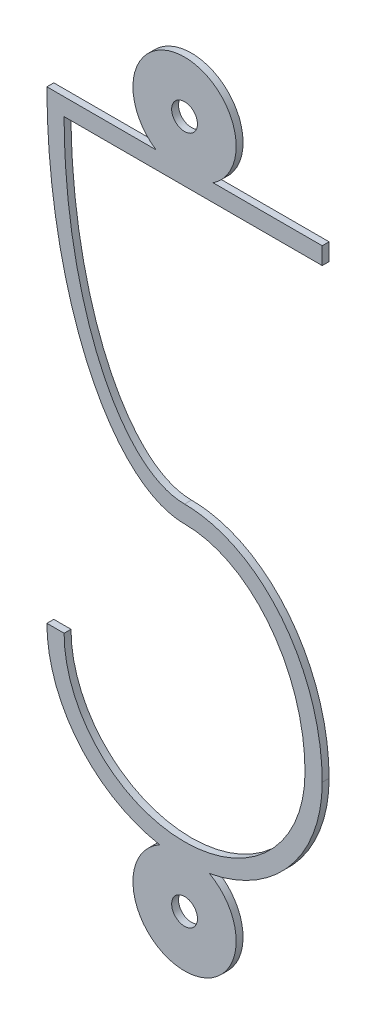
ISO-10303-21;
HEADER;
FILE_DESCRIPTION(('STEP AP214'),'2;1');
FILE_NAME('part.step','',(''),(''),'','','');
FILE_SCHEMA(('AUTOMOTIVE_DESIGN { 1 0 10303 214 1 1 1 1 }'));
ENDSEC;
DATA;
#1=APPLICATION_CONTEXT('core data for automotive mechanical design processes');
#2=APPLICATION_PROTOCOL_DEFINITION('international standard','automotive_design',2000,#1);
#3=PRODUCT_CONTEXT('',#1,'mechanical');
#4=PRODUCT('Part','Part','',(#3));
#5=PRODUCT_RELATED_PRODUCT_CATEGORY('part','',(#4));
#6=PRODUCT_DEFINITION_FORMATION('','',#4);
#7=PRODUCT_DEFINITION_CONTEXT('part definition',#1,'design');
#8=PRODUCT_DEFINITION('design','',#6,#7);
#9=PRODUCT_DEFINITION_SHAPE('','',#8);
#10=(LENGTH_UNIT() NAMED_UNIT(*) SI_UNIT(.MILLI.,.METRE.));
#11=(NAMED_UNIT(*) PLANE_ANGLE_UNIT() SI_UNIT($,.RADIAN.));
#12=(NAMED_UNIT(*) SI_UNIT($,.STERADIAN.) SOLID_ANGLE_UNIT());
#13=UNCERTAINTY_MEASURE_WITH_UNIT(LENGTH_MEASURE(1.E-05),#10,'distance_accuracy_value','');
#14=(GEOMETRIC_REPRESENTATION_CONTEXT(3) GLOBAL_UNCERTAINTY_ASSIGNED_CONTEXT((#13)) GLOBAL_UNIT_ASSIGNED_CONTEXT((#10,
#11,#12)) REPRESENTATION_CONTEXT('',''));
#15=CARTESIAN_POINT('',(0.,0.,0.));
#16=DIRECTION('',(0.,0.,1.));
#17=DIRECTION('',(1.,0.,0.));
#18=AXIS2_PLACEMENT_3D('',#15,#16,#17);
#19=CARTESIAN_POINT('',(-1.32932183617601E-13,8.75000000000002,0.1));
#20=DIRECTION('',(0.,0.,-1.));
#21=DIRECTION('',(-1.,0.,0.));
#22=AXIS2_PLACEMENT_3D('',#19,#20,#21);
#23=PLANE('',#22);
#24=CARTESIAN_POINT('',(-1.32932183617601E-13,8.75000000000002,0.1));
#25=DIRECTION('',(0.,0.,1.));
#26=DIRECTION('',(0.,1.,0.));
#27=AXIS2_PLACEMENT_3D('',#24,#25,#26);
#28=ELLIPSE('',#27,8.99999999999974,4.00000000000008);
#29=CARTESIAN_POINT('',(-4.00000000000022,8.74999999999979,0.1));
#30=VERTEX_POINT('',#29);
#31=CARTESIAN_POINT('',(0.,-0.250000000000186,0.1));
#32=VERTEX_POINT('',#31);
#33=EDGE_CURVE('E195',#30,#32,#28,.T.);
#34=ORIENTED_EDGE('',*,*,#33,.T.);
#35=CARTESIAN_POINT('',(0.,-4.74999999999968,0.1));
#36=DIRECTION('',(0.,0.,-1.));
#37=DIRECTION('',(0.,1.,0.));
#38=AXIS2_PLACEMENT_3D('',#35,#36,#37);
#39=ELLIPSE('',#38,4.49999999999949,3.49999999999958);
#40=CARTESIAN_POINT('',(3.49999999999954,-4.74999999999968,0.1));
#41=VERTEX_POINT('',#40);
#42=EDGE_CURVE('E113',#32,#41,#39,.T.);
#43=ORIENTED_EDGE('',*,*,#42,.T.);
#44=CARTESIAN_POINT('',(0.,-4.74999999999968,0.1));
#45=DIRECTION('',(0.,0.,-1.));
#46=DIRECTION('',(-1.,0.,0.));
#47=AXIS2_PLACEMENT_3D('',#44,#45,#46);
#48=CIRCLE('',#47,3.49999999999954);
#49=CARTESIAN_POINT('',(-3.49999999999949,-4.74999999999968,0.1));
#50=VERTEX_POINT('',#49);
#51=EDGE_CURVE('E228',#41,#50,#48,.T.);
#52=ORIENTED_EDGE('',*,*,#51,.T.);
#53=DIRECTION('',(-1.,0.,0.));
#54=VECTOR('',#53,1.);
#55=CARTESIAN_POINT('',(-4.00000000000022,-4.74999999999968,0.1));
#56=LINE('',#55,#54);
#57=CARTESIAN_POINT('',(-4.00000000000021,-4.74999999999968,0.1));
#58=VERTEX_POINT('',#57);
#59=EDGE_CURVE('E247',#50,#58,#56,.T.);
#60=ORIENTED_EDGE('',*,*,#59,.T.);
#61=CARTESIAN_POINT('',(0.,-4.74999999999968,0.1));
#62=DIRECTION('',(0.,0.,1.));
#63=DIRECTION('',(1.,0.,0.));
#64=AXIS2_PLACEMENT_3D('',#61,#62,#63);
#65=CIRCLE('',#64,4.00000000000021);
#66=CARTESIAN_POINT('',(-0.720779017653949,-8.68452380952371,0.1));
#67=VERTEX_POINT('',#66);
#68=EDGE_CURVE('E244',#58,#67,#65,.T.);
#69=ORIENTED_EDGE('',*,*,#68,.T.);
#70=CARTESIAN_POINT('',(-1.32932183617601E-13,-10.,0.1));
#71=DIRECTION('',(0.,0.,1.));
#72=DIRECTION('',(1.,0.,0.));
#73=AXIS2_PLACEMENT_3D('',#70,#71,#72);
#74=CIRCLE('',#73,1.5);
#75=CARTESIAN_POINT('',(0.720779017653747,-8.68452380952375,0.1));
#76=VERTEX_POINT('',#75);
#77=EDGE_CURVE('E246',#67,#76,#74,.T.);
#78=ORIENTED_EDGE('',*,*,#77,.T.);
#79=CARTESIAN_POINT('',(0.,-4.74999999999968,0.1));
#80=DIRECTION('',(0.,0.,1.));
#81=DIRECTION('',(1.,0.,0.));
#82=AXIS2_PLACEMENT_3D('',#79,#80,#81);
#83=CIRCLE('',#82,4.00000000000022);
#84=CARTESIAN_POINT('',(4.00000000000022,-4.74999999999968,0.1));
#85=VERTEX_POINT('',#84);
#86=EDGE_CURVE('E249',#76,#85,#83,.T.);
#87=ORIENTED_EDGE('',*,*,#86,.T.);
#88=CARTESIAN_POINT('',(0.,-4.74999999999968,0.1));
#89=DIRECTION('',(0.,0.,1.));
#90=DIRECTION('',(0.,1.,0.));
#91=AXIS2_PLACEMENT_3D('',#88,#89,#90);
#92=ELLIPSE('',#91,4.99999999999986,4.00000000000022);
#93=CARTESIAN_POINT('',(0.,0.250000000000188,0.1));
#94=VERTEX_POINT('',#93);
#95=EDGE_CURVE('E255',#85,#94,#92,.T.);
#96=ORIENTED_EDGE('',*,*,#95,.T.);
#97=CARTESIAN_POINT('',(-1.32932183617601E-13,8.24999999999906,0.1));
#98=DIRECTION('',(0.,0.,-1.));
#99=DIRECTION('',(0.,-1.,0.));
#100=AXIS2_PLACEMENT_3D('',#97,#98,#99);
#101=ELLIPSE('',#100,7.99999999999887,3.49999999999982);
#102=CARTESIAN_POINT('',(-3.49999999999995,8.24999999999906,0.1));
#103=VERTEX_POINT('',#102);
#104=EDGE_CURVE('E258',#94,#103,#101,.T.);
#105=ORIENTED_EDGE('',*,*,#104,.T.);
#106=DIRECTION('',(1.,0.,0.));
#107=VECTOR('',#106,1.);
#108=CARTESIAN_POINT('',(4.00000000000022,8.24999999999906,0.1));
#109=LINE('',#108,#107);
#110=CARTESIAN_POINT('',(4.00000000000022,8.24999999999906,0.1));
#111=VERTEX_POINT('',#110);
#112=EDGE_CURVE('E300',#103,#111,#109,.T.);
#113=ORIENTED_EDGE('',*,*,#112,.T.);
#114=DIRECTION('',(0.,1.,0.));
#115=VECTOR('',#114,1.);
#116=CARTESIAN_POINT('',(4.00000000000022,8.74999999999979,0.1));
#117=LINE('',#116,#115);
#118=CARTESIAN_POINT('',(4.00000000000022,8.74999999999979,0.1));
#119=VERTEX_POINT('',#118);
#120=EDGE_CURVE('E150',#111,#119,#117,.T.);
#121=ORIENTED_EDGE('',*,*,#120,.T.);
#122=DIRECTION('',(-1.,0.,0.));
#123=VECTOR('',#122,1.);
#124=CARTESIAN_POINT('',(0.829156197588529,8.74999999999979,0.1));
#125=LINE('',#124,#123);
#126=CARTESIAN_POINT('',(0.829156197588468,8.74999999999988,0.1));
#127=VERTEX_POINT('',#126);
#128=EDGE_CURVE('E144',#119,#127,#125,.T.);
#129=ORIENTED_EDGE('',*,*,#128,.T.);
#130=CARTESIAN_POINT('',(-1.32932183617601E-13,10.,0.1));
#131=DIRECTION('',(0.,0.,1.));
#132=DIRECTION('',(1.,0.,0.));
#133=AXIS2_PLACEMENT_3D('',#130,#131,#132);
#134=CIRCLE('',#133,1.49999999999996);
#135=CARTESIAN_POINT('',(-0.829156197588745,8.75000000000002,0.1));
#136=VERTEX_POINT('',#135);
#137=EDGE_CURVE('E148',#127,#136,#134,.T.);
#138=ORIENTED_EDGE('',*,*,#137,.T.);
#139=DIRECTION('',(-1.,0.,0.));
#140=VECTOR('',#139,1.);
#141=CARTESIAN_POINT('',(-4.00000000000022,8.74999999999979,0.1));
#142=LINE('',#141,#140);
#143=EDGE_CURVE('E52',#136,#30,#142,.T.);
#144=ORIENTED_EDGE('',*,*,#143,.T.);
#145=EDGE_LOOP('',(#34,#43,#52,#60,#69,#78,#87,#96,#105,#113,#121,#129,#138,#144));
#146=FACE_BOUND('',#145,.T.);
#147=CARTESIAN_POINT('',(-1.32932183617601E-13,-10.,0.1));
#148=DIRECTION('',(0.,0.,1.));
#149=DIRECTION('',(1.,0.,0.));
#150=AXIS2_PLACEMENT_3D('',#147,#148,#149);
#151=CIRCLE('',#150,0.374999999999808);
#152=CARTESIAN_POINT('',(0.374999999999675,-10.,0.1));
#153=VERTEX_POINT('',#152);
#154=EDGE_CURVE('E172',#153,#153,#151,.T.);
#155=ORIENTED_EDGE('',*,*,#154,.F.);
#156=EDGE_LOOP('',(#155));
#157=FACE_BOUND('',#156,.T.);
#158=CARTESIAN_POINT('',(-1.32932183617601E-13,10.,0.1));
#159=DIRECTION('',(0.,0.,1.));
#160=DIRECTION('',(1.,0.,0.));
#161=AXIS2_PLACEMENT_3D('',#158,#159,#160);
#162=CIRCLE('',#161,0.374999999999941);
#163=CARTESIAN_POINT('',(0.374999999999809,10.,0.1));
#164=VERTEX_POINT('',#163);
#165=EDGE_CURVE('E447',#164,#164,#162,.T.);
#166=ORIENTED_EDGE('',*,*,#165,.F.);
#167=EDGE_LOOP('',(#166));
#168=FACE_BOUND('',#167,.T.);
#169=ADVANCED_FACE('F34',(#146,#157,#168),#23,.F.);
#170=CARTESIAN_POINT('',(-1.32932183617601E-13,8.75000000000002,-0.1));
#171=DIRECTION('',(0.,0.,-1.));
#172=DIRECTION('',(-1.,0.,0.));
#173=AXIS2_PLACEMENT_3D('',#170,#171,#172);
#174=PLANE('',#173);
#175=CARTESIAN_POINT('',(-1.32932183617601E-13,-10.,-0.1));
#176=DIRECTION('',(0.,0.,1.));
#177=DIRECTION('',(1.,0.,0.));
#178=AXIS2_PLACEMENT_3D('',#175,#176,#177);
#179=CIRCLE('',#178,0.374999999999808);
#180=CARTESIAN_POINT('',(0.374999999999675,-10.,-0.1));
#181=VERTEX_POINT('',#180);
#182=EDGE_CURVE('E452',#181,#181,#179,.T.);
#183=ORIENTED_EDGE('',*,*,#182,.T.);
#184=EDGE_LOOP('',(#183));
#185=FACE_BOUND('',#184,.T.);
#186=CARTESIAN_POINT('',(-1.32932183617601E-13,8.75000000000002,-0.1));
#187=DIRECTION('',(0.,0.,1.));
#188=DIRECTION('',(0.,1.,0.));
#189=AXIS2_PLACEMENT_3D('',#186,#187,#188);
#190=ELLIPSE('',#189,8.99999999999974,4.00000000000008);
#191=CARTESIAN_POINT('',(-4.00000000000022,8.74999999999979,-0.1));
#192=VERTEX_POINT('',#191);
#193=CARTESIAN_POINT('',(0.,-0.250000000000186,-0.1));
#194=VERTEX_POINT('',#193);
#195=EDGE_CURVE('E168',#192,#194,#190,.T.);
#196=ORIENTED_EDGE('',*,*,#195,.F.);
#197=DIRECTION('',(-1.,0.,0.));
#198=VECTOR('',#197,1.);
#199=CARTESIAN_POINT('',(-4.00000000000022,8.74999999999979,-0.1));
#200=LINE('',#199,#198);
#201=CARTESIAN_POINT('',(-0.829156197588745,8.75000000000002,-0.1));
#202=VERTEX_POINT('',#201);
#203=EDGE_CURVE('E105',#202,#192,#200,.T.);
#204=ORIENTED_EDGE('',*,*,#203,.F.);
#205=CARTESIAN_POINT('',(-1.32932183617601E-13,10.,-0.1));
#206=DIRECTION('',(0.,0.,1.));
#207=DIRECTION('',(1.,0.,0.));
#208=AXIS2_PLACEMENT_3D('',#205,#206,#207);
#209=CIRCLE('',#208,1.49999999999996);
#210=CARTESIAN_POINT('',(0.829156197588468,8.74999999999988,-0.1));
#211=VERTEX_POINT('',#210);
#212=EDGE_CURVE('E99',#211,#202,#209,.T.);
#213=ORIENTED_EDGE('',*,*,#212,.F.);
#214=DIRECTION('',(-1.,0.,0.));
#215=VECTOR('',#214,1.);
#216=CARTESIAN_POINT('',(0.829156197588529,8.74999999999979,-0.1));
#217=LINE('',#216,#215);
#218=CARTESIAN_POINT('',(4.00000000000022,8.74999999999979,-0.1));
#219=VERTEX_POINT('',#218);
#220=EDGE_CURVE('E158',#219,#211,#217,.T.);
#221=ORIENTED_EDGE('',*,*,#220,.F.);
#222=DIRECTION('',(0.,1.,0.));
#223=VECTOR('',#222,1.);
#224=CARTESIAN_POINT('',(4.00000000000022,8.74999999999979,-0.1));
#225=LINE('',#224,#223);
#226=CARTESIAN_POINT('',(4.00000000000022,8.24999999999906,-0.1));
#227=VERTEX_POINT('',#226);
#228=EDGE_CURVE('E190',#227,#219,#225,.T.);
#229=ORIENTED_EDGE('',*,*,#228,.F.);
#230=DIRECTION('',(1.,0.,0.));
#231=VECTOR('',#230,1.);
#232=CARTESIAN_POINT('',(4.00000000000022,8.24999999999906,-0.1));
#233=LINE('',#232,#231);
#234=CARTESIAN_POINT('',(-3.49999999999995,8.24999999999906,-0.1));
#235=VERTEX_POINT('',#234);
#236=EDGE_CURVE('E188',#235,#227,#233,.T.);
#237=ORIENTED_EDGE('',*,*,#236,.F.);
#238=CARTESIAN_POINT('',(-1.32932183617601E-13,8.24999999999906,-0.1));
#239=DIRECTION('',(0.,0.,-1.));
#240=DIRECTION('',(0.,-1.,0.));
#241=AXIS2_PLACEMENT_3D('',#238,#239,#240);
#242=ELLIPSE('',#241,7.99999999999887,3.49999999999982);
#243=CARTESIAN_POINT('',(0.,0.250000000000188,-0.1));
#244=VERTEX_POINT('',#243);
#245=EDGE_CURVE('E186',#244,#235,#242,.T.);
#246=ORIENTED_EDGE('',*,*,#245,.F.);
#247=CARTESIAN_POINT('',(0.,-4.74999999999968,-0.1));
#248=DIRECTION('',(0.,0.,1.));
#249=DIRECTION('',(0.,1.,0.));
#250=AXIS2_PLACEMENT_3D('',#247,#248,#249);
#251=ELLIPSE('',#250,4.99999999999986,4.00000000000022);
#252=CARTESIAN_POINT('',(4.00000000000022,-4.74999999999968,-0.1));
#253=VERTEX_POINT('',#252);
#254=EDGE_CURVE('E184',#253,#244,#251,.T.);
#255=ORIENTED_EDGE('',*,*,#254,.F.);
#256=CARTESIAN_POINT('',(0.,-4.74999999999968,-0.1));
#257=DIRECTION('',(0.,0.,1.));
#258=DIRECTION('',(1.,0.,0.));
#259=AXIS2_PLACEMENT_3D('',#256,#257,#258);
#260=CIRCLE('',#259,4.00000000000022);
#261=CARTESIAN_POINT('',(0.720779017653747,-8.68452380952375,-0.1));
#262=VERTEX_POINT('',#261);
#263=EDGE_CURVE('E182',#262,#253,#260,.T.);
#264=ORIENTED_EDGE('',*,*,#263,.F.);
#265=CARTESIAN_POINT('',(-1.32932183617601E-13,-10.,-0.1));
#266=DIRECTION('',(0.,0.,1.));
#267=DIRECTION('',(1.,0.,0.));
#268=AXIS2_PLACEMENT_3D('',#265,#266,#267);
#269=CIRCLE('',#268,1.5);
#270=CARTESIAN_POINT('',(-0.720779017653949,-8.68452380952371,-0.1));
#271=VERTEX_POINT('',#270);
#272=EDGE_CURVE('E180',#271,#262,#269,.T.);
#273=ORIENTED_EDGE('',*,*,#272,.F.);
#274=CARTESIAN_POINT('',(0.,-4.74999999999968,-0.1));
#275=DIRECTION('',(0.,0.,1.));
#276=DIRECTION('',(1.,0.,0.));
#277=AXIS2_PLACEMENT_3D('',#274,#275,#276);
#278=CIRCLE('',#277,4.00000000000021);
#279=CARTESIAN_POINT('',(-4.00000000000021,-4.74999999999968,-0.1));
#280=VERTEX_POINT('',#279);
#281=EDGE_CURVE('E178',#280,#271,#278,.T.);
#282=ORIENTED_EDGE('',*,*,#281,.F.);
#283=DIRECTION('',(-1.,0.,0.));
#284=VECTOR('',#283,1.);
#285=CARTESIAN_POINT('',(-4.00000000000022,-4.74999999999968,-0.1));
#286=LINE('',#285,#284);
#287=CARTESIAN_POINT('',(-3.49999999999949,-4.74999999999968,-0.1));
#288=VERTEX_POINT('',#287);
#289=EDGE_CURVE('E176',#288,#280,#286,.T.);
#290=ORIENTED_EDGE('',*,*,#289,.F.);
#291=CARTESIAN_POINT('',(0.,-4.74999999999968,-0.1));
#292=DIRECTION('',(0.,0.,-1.));
#293=DIRECTION('',(-1.,0.,0.));
#294=AXIS2_PLACEMENT_3D('',#291,#292,#293);
#295=CIRCLE('',#294,3.49999999999954);
#296=CARTESIAN_POINT('',(3.49999999999954,-4.74999999999968,-0.1));
#297=VERTEX_POINT('',#296);
#298=EDGE_CURVE('E174',#297,#288,#295,.T.);
#299=ORIENTED_EDGE('',*,*,#298,.F.);
#300=CARTESIAN_POINT('',(0.,-4.74999999999968,-0.1));
#301=DIRECTION('',(0.,0.,-1.));
#302=DIRECTION('',(0.,1.,0.));
#303=AXIS2_PLACEMENT_3D('',#300,#301,#302);
#304=ELLIPSE('',#303,4.49999999999949,3.49999999999958);
#305=EDGE_CURVE('E171',#194,#297,#304,.T.);
#306=ORIENTED_EDGE('',*,*,#305,.F.);
#307=EDGE_LOOP('',(#196,#204,#213,#221,#229,#237,#246,#255,#264,#273,#282,#290,#299,#306));
#308=FACE_BOUND('',#307,.T.);
#309=CARTESIAN_POINT('',(-1.32932183617601E-13,10.,-0.1));
#310=DIRECTION('',(0.,0.,1.));
#311=DIRECTION('',(1.,0.,0.));
#312=AXIS2_PLACEMENT_3D('',#309,#310,#311);
#313=CIRCLE('',#312,0.374999999999941);
#314=CARTESIAN_POINT('',(0.374999999999809,10.,-0.1));
#315=VERTEX_POINT('',#314);
#316=EDGE_CURVE('E450',#315,#315,#313,.T.);
#317=ORIENTED_EDGE('',*,*,#316,.T.);
#318=EDGE_LOOP('',(#317));
#319=FACE_BOUND('',#318,.T.);
#320=ADVANCED_FACE('F232',(#185,#308,#319),#174,.T.);
#321=DIRECTION('',(0.,0.,-1.));
#322=VECTOR('',#321,1.);
#323=SURFACE_OF_LINEAR_EXTRUSION('',#28,#322);
#324=ORIENTED_EDGE('',*,*,#195,.T.);
#325=DIRECTION('',(0.,0.,-1.));
#326=VECTOR('',#325,1.);
#327=CARTESIAN_POINT('',(0.,-0.250000000000186,0.1));
#328=LINE('',#327,#326);
#329=EDGE_CURVE('E11',#32,#194,#328,.T.);
#330=ORIENTED_EDGE('',*,*,#329,.F.);
#331=ORIENTED_EDGE('',*,*,#33,.F.);
#332=DIRECTION('',(0.,0.,-1.));
#333=VECTOR('',#332,1.);
#334=CARTESIAN_POINT('',(-4.00000000000022,8.74999999999979,0.1));
#335=LINE('',#334,#333);
#336=EDGE_CURVE('E164',#30,#192,#335,.T.);
#337=ORIENTED_EDGE('',*,*,#336,.T.);
#338=EDGE_LOOP('',(#324,#330,#331,#337));
#339=FACE_BOUND('',#338,.T.);
#340=ADVANCED_FACE('F36',(#339),#323,.F.);
#341=DIRECTION('',(0.,0.,-1.));
#342=VECTOR('',#341,1.);
#343=SURFACE_OF_LINEAR_EXTRUSION('',#39,#342);
#344=ORIENTED_EDGE('',*,*,#305,.T.);
#345=DIRECTION('',(0.,0.,-1.));
#346=VECTOR('',#345,1.);
#347=CARTESIAN_POINT('',(3.49999999999954,-4.74999999999968,0.1));
#348=LINE('',#347,#346);
#349=EDGE_CURVE('E44',#41,#297,#348,.T.);
#350=ORIENTED_EDGE('',*,*,#349,.F.);
#351=ORIENTED_EDGE('',*,*,#42,.F.);
#352=ORIENTED_EDGE('',*,*,#329,.T.);
#353=EDGE_LOOP('',(#344,#350,#351,#352));
#354=FACE_BOUND('',#353,.T.);
#355=ADVANCED_FACE('F282',(#354),#343,.F.);
#356=CARTESIAN_POINT('',(0.,-4.74999999999968,0.1));
#357=DIRECTION('',(0.,0.,-1.));
#358=DIRECTION('',(-1.,0.,0.));
#359=AXIS2_PLACEMENT_3D('',#356,#357,#358);
#360=CYLINDRICAL_SURFACE('',#359,3.49999999999954);
#361=ORIENTED_EDGE('',*,*,#298,.T.);
#362=DIRECTION('',(0.,0.,-1.));
#363=VECTOR('',#362,1.);
#364=CARTESIAN_POINT('',(-3.49999999999949,-4.74999999999968,0.1));
#365=LINE('',#364,#363);
#366=EDGE_CURVE('E220',#50,#288,#365,.T.);
#367=ORIENTED_EDGE('',*,*,#366,.F.);
#368=ORIENTED_EDGE('',*,*,#51,.F.);
#369=ORIENTED_EDGE('',*,*,#349,.T.);
#370=EDGE_LOOP('',(#361,#367,#368,#369));
#371=FACE_BOUND('',#370,.T.);
#372=ADVANCED_FACE('F226',(#371),#360,.F.);
#373=CARTESIAN_POINT('',(-4.00000000000022,-4.74999999999968,0.1));
#374=DIRECTION('',(0.,-1.,0.));
#375=DIRECTION('',(0.,0.,-1.));
#376=AXIS2_PLACEMENT_3D('',#373,#374,#375);
#377=PLANE('',#376);
#378=ORIENTED_EDGE('',*,*,#289,.T.);
#379=DIRECTION('',(0.,0.,-1.));
#380=VECTOR('',#379,1.);
#381=CARTESIAN_POINT('',(-4.00000000000021,-4.74999999999968,0.1));
#382=LINE('',#381,#380);
#383=EDGE_CURVE('E217',#58,#280,#382,.T.);
#384=ORIENTED_EDGE('',*,*,#383,.F.);
#385=ORIENTED_EDGE('',*,*,#59,.F.);
#386=ORIENTED_EDGE('',*,*,#366,.T.);
#387=EDGE_LOOP('',(#378,#384,#385,#386));
#388=FACE_BOUND('',#387,.T.);
#389=ADVANCED_FACE('F238',(#388),#377,.F.);
#390=CARTESIAN_POINT('',(0.,-4.74999999999968,0.1));
#391=DIRECTION('',(0.,0.,-1.));
#392=DIRECTION('',(-1.,0.,0.));
#393=AXIS2_PLACEMENT_3D('',#390,#391,#392);
#394=CYLINDRICAL_SURFACE('',#393,4.00000000000021);
#395=ORIENTED_EDGE('',*,*,#281,.T.);
#396=DIRECTION('',(0.,0.,-1.));
#397=VECTOR('',#396,1.);
#398=CARTESIAN_POINT('',(-0.720779017653949,-8.68452380952371,0.1));
#399=LINE('',#398,#397);
#400=EDGE_CURVE('E214',#67,#271,#399,.T.);
#401=ORIENTED_EDGE('',*,*,#400,.F.);
#402=ORIENTED_EDGE('',*,*,#68,.F.);
#403=ORIENTED_EDGE('',*,*,#383,.T.);
#404=EDGE_LOOP('',(#395,#401,#402,#403));
#405=FACE_BOUND('',#404,.T.);
#406=ADVANCED_FACE('F242',(#405),#394,.T.);
#407=CARTESIAN_POINT('',(-1.32932183617601E-13,-10.,0.1));
#408=DIRECTION('',(0.,0.,-1.));
#409=DIRECTION('',(-1.,0.,0.));
#410=AXIS2_PLACEMENT_3D('',#407,#408,#409);
#411=CYLINDRICAL_SURFACE('',#410,1.5);
#412=ORIENTED_EDGE('',*,*,#272,.T.);
#413=DIRECTION('',(0.,0.,-1.));
#414=VECTOR('',#413,1.);
#415=CARTESIAN_POINT('',(0.720779017653747,-8.68452380952375,0.1));
#416=LINE('',#415,#414);
#417=EDGE_CURVE('E211',#76,#262,#416,.T.);
#418=ORIENTED_EDGE('',*,*,#417,.F.);
#419=ORIENTED_EDGE('',*,*,#77,.F.);
#420=ORIENTED_EDGE('',*,*,#400,.T.);
#421=EDGE_LOOP('',(#412,#418,#419,#420));
#422=FACE_BOUND('',#421,.T.);
#423=ADVANCED_FACE('F272',(#422),#411,.T.);
#424=CARTESIAN_POINT('',(0.,-4.74999999999968,0.1));
#425=DIRECTION('',(0.,0.,-1.));
#426=DIRECTION('',(-1.,0.,0.));
#427=AXIS2_PLACEMENT_3D('',#424,#425,#426);
#428=CYLINDRICAL_SURFACE('',#427,4.00000000000022);
#429=ORIENTED_EDGE('',*,*,#263,.T.);
#430=DIRECTION('',(0.,0.,-1.));
#431=VECTOR('',#430,1.);
#432=CARTESIAN_POINT('',(4.00000000000022,-4.74999999999968,0.1));
#433=LINE('',#432,#431);
#434=EDGE_CURVE('E208',#85,#253,#433,.T.);
#435=ORIENTED_EDGE('',*,*,#434,.F.);
#436=ORIENTED_EDGE('',*,*,#86,.F.);
#437=ORIENTED_EDGE('',*,*,#417,.T.);
#438=EDGE_LOOP('',(#429,#435,#436,#437));
#439=FACE_BOUND('',#438,.T.);
#440=ADVANCED_FACE('F267',(#439),#428,.T.);
#441=DIRECTION('',(0.,0.,-1.));
#442=VECTOR('',#441,1.);
#443=SURFACE_OF_LINEAR_EXTRUSION('',#92,#442);
#444=ORIENTED_EDGE('',*,*,#254,.T.);
#445=DIRECTION('',(0.,0.,-1.));
#446=VECTOR('',#445,1.);
#447=CARTESIAN_POINT('',(0.,0.250000000000188,0.1));
#448=LINE('',#447,#446);
#449=EDGE_CURVE('E205',#94,#244,#448,.T.);
#450=ORIENTED_EDGE('',*,*,#449,.F.);
#451=ORIENTED_EDGE('',*,*,#95,.F.);
#452=ORIENTED_EDGE('',*,*,#434,.T.);
#453=EDGE_LOOP('',(#444,#450,#451,#452));
#454=FACE_BOUND('',#453,.T.);
#455=ADVANCED_FACE('F262',(#454),#443,.F.);
#456=DIRECTION('',(0.,0.,-1.));
#457=VECTOR('',#456,1.);
#458=SURFACE_OF_LINEAR_EXTRUSION('',#101,#457);
#459=ORIENTED_EDGE('',*,*,#245,.T.);
#460=DIRECTION('',(0.,0.,-1.));
#461=VECTOR('',#460,1.);
#462=CARTESIAN_POINT('',(-3.49999999999995,8.24999999999906,0.1));
#463=LINE('',#462,#461);
#464=EDGE_CURVE('E202',#103,#235,#463,.T.);
#465=ORIENTED_EDGE('',*,*,#464,.F.);
#466=ORIENTED_EDGE('',*,*,#104,.F.);
#467=ORIENTED_EDGE('',*,*,#449,.T.);
#468=EDGE_LOOP('',(#459,#465,#466,#467));
#469=FACE_BOUND('',#468,.T.);
#470=ADVANCED_FACE('F266',(#469),#458,.F.);
#471=CARTESIAN_POINT('',(4.00000000000022,8.24999999999906,0.1));
#472=DIRECTION('',(0.,1.,0.));
#473=DIRECTION('',(0.,0.,1.));
#474=AXIS2_PLACEMENT_3D('',#471,#472,#473);
#475=PLANE('',#474);
#476=ORIENTED_EDGE('',*,*,#236,.T.);
#477=DIRECTION('',(0.,0.,-1.));
#478=VECTOR('',#477,1.);
#479=CARTESIAN_POINT('',(4.00000000000022,8.24999999999906,0.1));
#480=LINE('',#479,#478);
#481=EDGE_CURVE('E199',#111,#227,#480,.T.);
#482=ORIENTED_EDGE('',*,*,#481,.F.);
#483=ORIENTED_EDGE('',*,*,#112,.F.);
#484=ORIENTED_EDGE('',*,*,#464,.T.);
#485=EDGE_LOOP('',(#476,#482,#483,#484));
#486=FACE_BOUND('',#485,.T.);
#487=ADVANCED_FACE('F299',(#486),#475,.F.);
#488=CARTESIAN_POINT('',(4.00000000000022,8.74999999999979,0.1));
#489=DIRECTION('',(-1.,0.,0.));
#490=DIRECTION('',(0.,0.,1.));
#491=AXIS2_PLACEMENT_3D('',#488,#489,#490);
#492=PLANE('',#491);
#493=ORIENTED_EDGE('',*,*,#228,.T.);
#494=DIRECTION('',(0.,0.,-1.));
#495=VECTOR('',#494,1.);
#496=CARTESIAN_POINT('',(4.00000000000022,8.74999999999979,0.1));
#497=LINE('',#496,#495);
#498=EDGE_CURVE('E159',#119,#219,#497,.T.);
#499=ORIENTED_EDGE('',*,*,#498,.F.);
#500=ORIENTED_EDGE('',*,*,#120,.F.);
#501=ORIENTED_EDGE('',*,*,#481,.T.);
#502=EDGE_LOOP('',(#493,#499,#500,#501));
#503=FACE_BOUND('',#502,.T.);
#504=ADVANCED_FACE('F295',(#503),#492,.F.);
#505=CARTESIAN_POINT('',(0.829156197588529,8.74999999999979,0.1));
#506=DIRECTION('',(0.,-1.,0.));
#507=DIRECTION('',(0.,0.,-1.));
#508=AXIS2_PLACEMENT_3D('',#505,#506,#507);
#509=PLANE('',#508);
#510=ORIENTED_EDGE('',*,*,#220,.T.);
#511=DIRECTION('',(0.,0.,-1.));
#512=VECTOR('',#511,1.);
#513=CARTESIAN_POINT('',(0.829156197588468,8.74999999999988,0.1));
#514=LINE('',#513,#512);
#515=EDGE_CURVE('E155',#127,#211,#514,.T.);
#516=ORIENTED_EDGE('',*,*,#515,.F.);
#517=ORIENTED_EDGE('',*,*,#128,.F.);
#518=ORIENTED_EDGE('',*,*,#498,.T.);
#519=EDGE_LOOP('',(#510,#516,#517,#518));
#520=FACE_BOUND('',#519,.T.);
#521=ADVANCED_FACE('F156',(#520),#509,.F.);
#522=CARTESIAN_POINT('',(-1.32932183617601E-13,10.,0.1));
#523=DIRECTION('',(0.,0.,-1.));
#524=DIRECTION('',(-1.,0.,0.));
#525=AXIS2_PLACEMENT_3D('',#522,#523,#524);
#526=CYLINDRICAL_SURFACE('',#525,1.49999999999996);
#527=ORIENTED_EDGE('',*,*,#212,.T.);
#528=DIRECTION('',(0.,0.,-1.));
#529=VECTOR('',#528,1.);
#530=CARTESIAN_POINT('',(-0.829156197588745,8.75000000000002,0.1));
#531=LINE('',#530,#529);
#532=EDGE_CURVE('E160',#136,#202,#531,.T.);
#533=ORIENTED_EDGE('',*,*,#532,.F.);
#534=ORIENTED_EDGE('',*,*,#137,.F.);
#535=ORIENTED_EDGE('',*,*,#515,.T.);
#536=EDGE_LOOP('',(#527,#533,#534,#535));
#537=FACE_BOUND('',#536,.T.);
#538=ADVANCED_FACE('F162',(#537),#526,.T.);
#539=CARTESIAN_POINT('',(-4.00000000000022,8.74999999999979,0.1));
#540=DIRECTION('',(0.,-1.,0.));
#541=DIRECTION('',(1.,0.,0.));
#542=AXIS2_PLACEMENT_3D('',#539,#540,#541);
#543=PLANE('',#542);
#544=ORIENTED_EDGE('',*,*,#203,.T.);
#545=ORIENTED_EDGE('',*,*,#336,.F.);
#546=ORIENTED_EDGE('',*,*,#143,.F.);
#547=ORIENTED_EDGE('',*,*,#532,.T.);
#548=EDGE_LOOP('',(#544,#545,#546,#547));
#549=FACE_BOUND('',#548,.T.);
#550=ADVANCED_FACE('F326',(#549),#543,.F.);
#551=CARTESIAN_POINT('',(-1.32932183617601E-13,-10.,0.1));
#552=DIRECTION('',(0.,0.,-1.));
#553=DIRECTION('',(-1.,0.,0.));
#554=AXIS2_PLACEMENT_3D('',#551,#552,#553);
#555=CYLINDRICAL_SURFACE('',#554,0.374999999999808);
#556=ORIENTED_EDGE('',*,*,#154,.T.);
#557=EDGE_LOOP('',(#556));
#558=FACE_BOUND('',#557,.T.);
#559=ORIENTED_EDGE('',*,*,#182,.F.);
#560=EDGE_LOOP('',(#559));
#561=FACE_BOUND('',#560,.T.);
#562=ADVANCED_FACE('F323',(#558,#561),#555,.F.);
#563=CARTESIAN_POINT('',(-1.32932183617601E-13,10.,0.1));
#564=DIRECTION('',(0.,0.,-1.));
#565=DIRECTION('',(-1.,0.,0.));
#566=AXIS2_PLACEMENT_3D('',#563,#564,#565);
#567=CYLINDRICAL_SURFACE('',#566,0.374999999999941);
#568=ORIENTED_EDGE('',*,*,#165,.T.);
#569=EDGE_LOOP('',(#568));
#570=FACE_BOUND('',#569,.T.);
#571=ORIENTED_EDGE('',*,*,#316,.F.);
#572=EDGE_LOOP('',(#571));
#573=FACE_BOUND('',#572,.T.);
#574=ADVANCED_FACE('F356',(#570,#573),#567,.F.);
#575=CLOSED_SHELL('',(#169,#320,#340,#355,#372,#389,#406,#423,#440,#455,#470,#487,#504,#521,
#538,#550,#562,#574));
#576=MANIFOLD_SOLID_BREP('B2',#575);
#577=ADVANCED_BREP_SHAPE_REPRESENTATION('',(#18,#576),#14);
#578=SHAPE_DEFINITION_REPRESENTATION(#9,#577);
ENDSEC;
END-ISO-10303-21;
